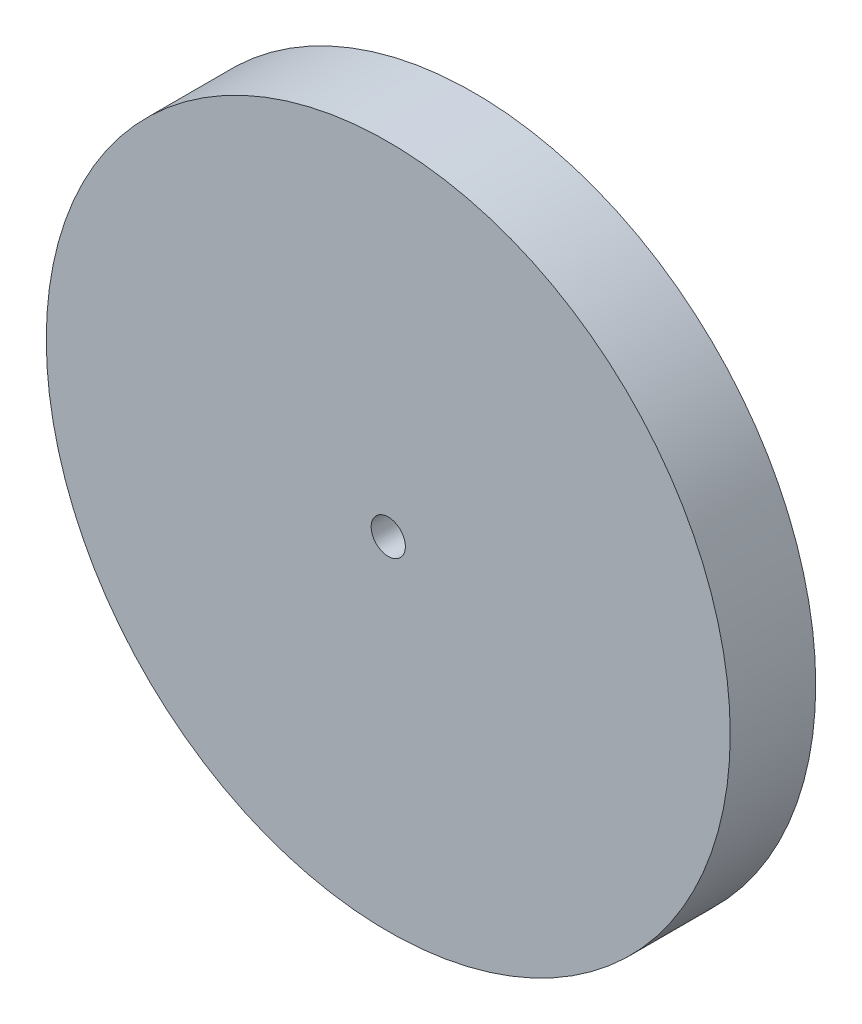
ISO-10303-21;
HEADER;
FILE_DESCRIPTION(('STEP AP214'),'2;1');
FILE_NAME('part.step','',(''),(''),'','','');
FILE_SCHEMA(('AUTOMOTIVE_DESIGN { 1 0 10303 214 1 1 1 1 }'));
ENDSEC;
DATA;
#1=APPLICATION_CONTEXT('core data for automotive mechanical design processes');
#2=APPLICATION_PROTOCOL_DEFINITION('international standard','automotive_design',2000,#1);
#3=PRODUCT_CONTEXT('',#1,'mechanical');
#4=PRODUCT('Part','Part','',(#3));
#5=PRODUCT_RELATED_PRODUCT_CATEGORY('part','',(#4));
#6=PRODUCT_DEFINITION_FORMATION('','',#4);
#7=PRODUCT_DEFINITION_CONTEXT('part definition',#1,'design');
#8=PRODUCT_DEFINITION('design','',#6,#7);
#9=PRODUCT_DEFINITION_SHAPE('','',#8);
#10=(LENGTH_UNIT() NAMED_UNIT(*) SI_UNIT(.MILLI.,.METRE.));
#11=(NAMED_UNIT(*) PLANE_ANGLE_UNIT() SI_UNIT($,.RADIAN.));
#12=(NAMED_UNIT(*) SI_UNIT($,.STERADIAN.) SOLID_ANGLE_UNIT());
#13=UNCERTAINTY_MEASURE_WITH_UNIT(LENGTH_MEASURE(1.E-05),#10,'distance_accuracy_value','');
#14=(GEOMETRIC_REPRESENTATION_CONTEXT(3) GLOBAL_UNCERTAINTY_ASSIGNED_CONTEXT((#13)) GLOBAL_UNIT_ASSIGNED_CONTEXT((#10,
#11,#12)) REPRESENTATION_CONTEXT('',''));
#15=CARTESIAN_POINT('',(0.,0.,0.));
#16=DIRECTION('',(0.,0.,1.));
#17=DIRECTION('',(1.,0.,0.));
#18=AXIS2_PLACEMENT_3D('',#15,#16,#17);
#19=CARTESIAN_POINT('',(5.48933539957237E-13,-25.3999999999999,6.35));
#20=DIRECTION('',(0.,0.,1.));
#21=DIRECTION('',(1.,0.,0.));
#22=AXIS2_PLACEMENT_3D('',#19,#20,#21);
#23=PLANE('',#22);
#24=CARTESIAN_POINT('',(5.48933539957237E-13,-25.3999999999999,6.35));
#25=DIRECTION('',(0.,0.,1.));
#26=DIRECTION('',(1.,0.,0.));
#27=AXIS2_PLACEMENT_3D('',#24,#25,#26);
#28=CIRCLE('',#27,25.4);
#29=CARTESIAN_POINT('',(25.4000000000005,-25.3999999999999,6.35));
#30=VERTEX_POINT('',#29);
#31=EDGE_CURVE('E10',#30,#30,#28,.T.);
#32=ORIENTED_EDGE('',*,*,#31,.T.);
#33=EDGE_LOOP('',(#32));
#34=FACE_BOUND('',#33,.T.);
#35=CARTESIAN_POINT('',(5.48933539957237E-13,-25.3999999999999,6.35));
#36=DIRECTION('',(0.,0.,1.));
#37=DIRECTION('',(1.,0.,0.));
#38=AXIS2_PLACEMENT_3D('',#35,#36,#37);
#39=CIRCLE('',#38,1.27);
#40=CARTESIAN_POINT('',(1.27000000000055,-25.3999999999999,6.35));
#41=VERTEX_POINT('',#40);
#42=EDGE_CURVE('E42',#41,#41,#39,.T.);
#43=ORIENTED_EDGE('',*,*,#42,.F.);
#44=EDGE_LOOP('',(#43));
#45=FACE_BOUND('',#44,.T.);
#46=ADVANCED_FACE('F31',(#34,#45),#23,.T.);
#47=CARTESIAN_POINT('',(5.48933539957237E-13,-25.3999999999999,0.));
#48=DIRECTION('',(0.,0.,1.));
#49=DIRECTION('',(1.,0.,0.));
#50=AXIS2_PLACEMENT_3D('',#47,#48,#49);
#51=PLANE('',#50);
#52=CARTESIAN_POINT('',(5.48933539957237E-13,-25.3999999999999,0.));
#53=DIRECTION('',(0.,0.,1.));
#54=DIRECTION('',(1.,0.,0.));
#55=AXIS2_PLACEMENT_3D('',#52,#53,#54);
#56=CIRCLE('',#55,25.4);
#57=CARTESIAN_POINT('',(25.4000000000005,-25.3999999999999,0.));
#58=VERTEX_POINT('',#57);
#59=EDGE_CURVE('E35',#58,#58,#56,.T.);
#60=ORIENTED_EDGE('',*,*,#59,.F.);
#61=EDGE_LOOP('',(#60));
#62=FACE_BOUND('',#61,.T.);
#63=CARTESIAN_POINT('',(5.48933539957237E-13,-25.3999999999999,0.));
#64=DIRECTION('',(0.,0.,1.));
#65=DIRECTION('',(1.,0.,0.));
#66=AXIS2_PLACEMENT_3D('',#63,#64,#65);
#67=CIRCLE('',#66,1.27);
#68=CARTESIAN_POINT('',(1.27000000000055,-25.3999999999999,0.));
#69=VERTEX_POINT('',#68);
#70=EDGE_CURVE('E44',#69,#69,#67,.T.);
#71=ORIENTED_EDGE('',*,*,#70,.T.);
#72=EDGE_LOOP('',(#71));
#73=FACE_BOUND('',#72,.T.);
#74=ADVANCED_FACE('F54',(#62,#73),#51,.F.);
#75=CARTESIAN_POINT('',(5.48933539957237E-13,-25.3999999999999,6.35));
#76=DIRECTION('',(0.,0.,-1.));
#77=DIRECTION('',(-1.,0.,0.));
#78=AXIS2_PLACEMENT_3D('',#75,#76,#77);
#79=CYLINDRICAL_SURFACE('',#78,25.4);
#80=ORIENTED_EDGE('',*,*,#31,.F.);
#81=EDGE_LOOP('',(#80));
#82=FACE_BOUND('',#81,.T.);
#83=ORIENTED_EDGE('',*,*,#59,.T.);
#84=EDGE_LOOP('',(#83));
#85=FACE_BOUND('',#84,.T.);
#86=ADVANCED_FACE('F33',(#82,#85),#79,.T.);
#87=CARTESIAN_POINT('',(5.48933539957237E-13,-25.3999999999999,6.35));
#88=DIRECTION('',(0.,0.,-1.));
#89=DIRECTION('',(-1.,0.,0.));
#90=AXIS2_PLACEMENT_3D('',#87,#88,#89);
#91=CYLINDRICAL_SURFACE('',#90,1.27);
#92=ORIENTED_EDGE('',*,*,#42,.T.);
#93=EDGE_LOOP('',(#92));
#94=FACE_BOUND('',#93,.T.);
#95=ORIENTED_EDGE('',*,*,#70,.F.);
#96=EDGE_LOOP('',(#95));
#97=FACE_BOUND('',#96,.T.);
#98=ADVANCED_FACE('F50',(#94,#97),#91,.F.);
#99=CLOSED_SHELL('',(#46,#74,#86,#98));
#100=MANIFOLD_SOLID_BREP('B2',#99);
#101=ADVANCED_BREP_SHAPE_REPRESENTATION('',(#18,#100),#14);
#102=SHAPE_DEFINITION_REPRESENTATION(#9,#101);
ENDSEC;
END-ISO-10303-21;
